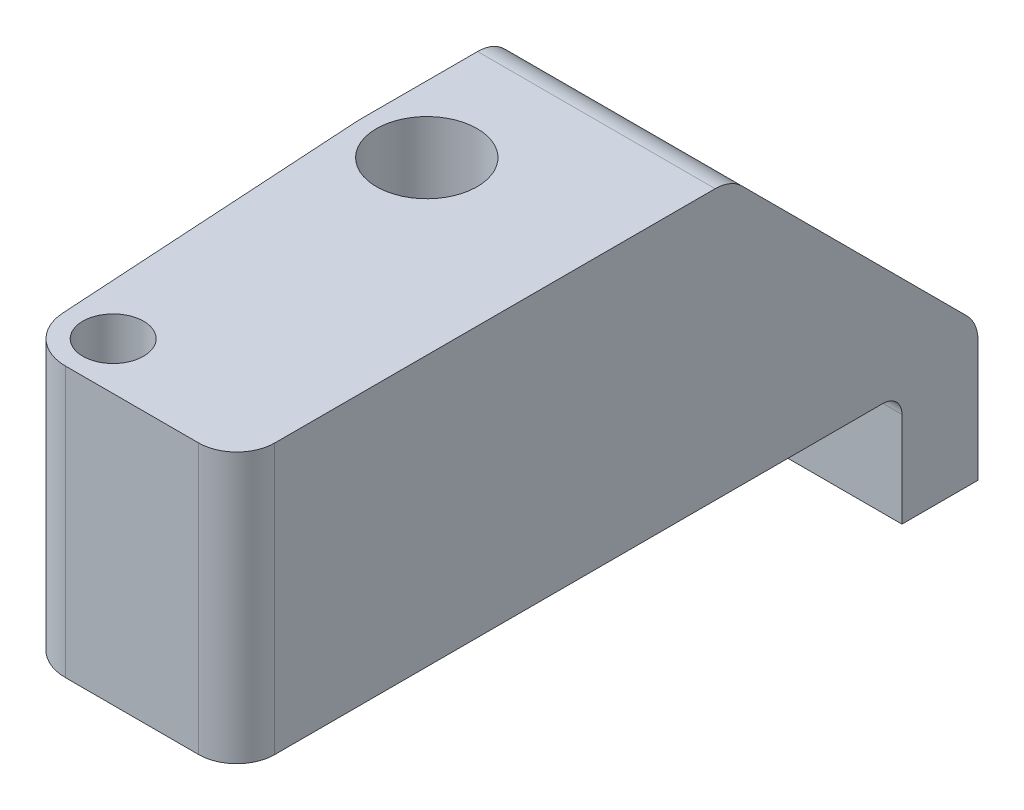
ISO-10303-21;
HEADER;
FILE_DESCRIPTION(('STEP AP214'),'2;1');
FILE_NAME('part.step','',(''),(''),'','','');
FILE_SCHEMA(('AUTOMOTIVE_DESIGN { 1 0 10303 214 1 1 1 1 }'));
ENDSEC;
DATA;
#1=APPLICATION_CONTEXT('core data for automotive mechanical design processes');
#2=APPLICATION_PROTOCOL_DEFINITION('international standard','automotive_design',2000,#1);
#3=PRODUCT_CONTEXT('',#1,'mechanical');
#4=PRODUCT('Part','Part','',(#3));
#5=PRODUCT_RELATED_PRODUCT_CATEGORY('part','',(#4));
#6=PRODUCT_DEFINITION_FORMATION('','',#4);
#7=PRODUCT_DEFINITION_CONTEXT('part definition',#1,'design');
#8=PRODUCT_DEFINITION('design','',#6,#7);
#9=PRODUCT_DEFINITION_SHAPE('','',#8);
#10=(LENGTH_UNIT() NAMED_UNIT(*) SI_UNIT(.MILLI.,.METRE.));
#11=(NAMED_UNIT(*) PLANE_ANGLE_UNIT() SI_UNIT($,.RADIAN.));
#12=(NAMED_UNIT(*) SI_UNIT($,.STERADIAN.) SOLID_ANGLE_UNIT());
#13=UNCERTAINTY_MEASURE_WITH_UNIT(LENGTH_MEASURE(1.E-05),#10,'distance_accuracy_value','');
#14=(GEOMETRIC_REPRESENTATION_CONTEXT(3) GLOBAL_UNCERTAINTY_ASSIGNED_CONTEXT((#13)) GLOBAL_UNIT_ASSIGNED_CONTEXT((#10,
#11,#12)) REPRESENTATION_CONTEXT('',''));
#15=CARTESIAN_POINT('',(0.,0.,0.));
#16=DIRECTION('',(0.,0.,1.));
#17=DIRECTION('',(1.,0.,0.));
#18=AXIS2_PLACEMENT_3D('',#15,#16,#17);
#19=CARTESIAN_POINT('',(9.,29.369351802563,-32.5));
#20=DIRECTION('',(0.,0.,1.));
#21=DIRECTION('',(1.,0.,0.));
#22=AXIS2_PLACEMENT_3D('',#19,#20,#21);
#23=PLANE('',#22);
#24=DIRECTION('',(0.,-1.,0.));
#25=VECTOR('',#24,1.);
#26=CARTESIAN_POINT('',(-3.5,14.2,-32.5));
#27=LINE('',#26,#25);
#28=CARTESIAN_POINT('',(-3.5,0.,-32.5));
#29=VERTEX_POINT('',#28);
#30=CARTESIAN_POINT('',(-3.5,-0.999999999999999,-32.5));
#31=VERTEX_POINT('',#30);
#32=EDGE_CURVE('E175',#29,#31,#27,.T.);
#33=ORIENTED_EDGE('',*,*,#32,.F.);
#34=DIRECTION('',(-1.,0.,0.));
#35=VECTOR('',#34,1.);
#36=CARTESIAN_POINT('',(9.,0.,-32.5));
#37=LINE('',#36,#35);
#38=CARTESIAN_POINT('',(-5.63247190702654,0.,-32.5));
#39=VERTEX_POINT('',#38);
#40=EDGE_CURVE('E159',#29,#39,#37,.T.);
#41=ORIENTED_EDGE('',*,*,#40,.T.);
#42=DIRECTION('',(0.,-1.,0.));
#43=VECTOR('',#42,1.);
#44=CARTESIAN_POINT('',(-5.63247190702654,29.369351802563,-32.5));
#45=LINE('',#44,#43);
#46=CARTESIAN_POINT('',(-5.63247190702654,-6.,-32.5));
#47=VERTEX_POINT('',#46);
#48=EDGE_CURVE('E269',#39,#47,#45,.T.);
#49=ORIENTED_EDGE('',*,*,#48,.T.);
#50=DIRECTION('',(-1.,0.,0.));
#51=VECTOR('',#50,1.);
#52=CARTESIAN_POINT('',(9.,-6.,-32.5));
#53=LINE('',#52,#51);
#54=CARTESIAN_POINT('',(9.,-6.,-32.5));
#55=VERTEX_POINT('',#54);
#56=EDGE_CURVE('E260',#55,#47,#53,.T.);
#57=ORIENTED_EDGE('',*,*,#56,.F.);
#58=DIRECTION('',(0.,-1.,0.));
#59=VECTOR('',#58,1.);
#60=CARTESIAN_POINT('',(9.,29.369351802563,-32.5));
#61=LINE('',#60,#59);
#62=CARTESIAN_POINT('',(9.,-1.,-32.5));
#63=VERTEX_POINT('',#62);
#64=EDGE_CURVE('E272',#63,#55,#61,.T.);
#65=ORIENTED_EDGE('',*,*,#64,.F.);
#66=DIRECTION('',(1.,0.,0.));
#67=VECTOR('',#66,1.);
#68=CARTESIAN_POINT('',(9.,-1.,-32.5));
#69=LINE('',#68,#67);
#70=EDGE_CURVE('E182',#63,#31,#69,.F.);
#71=ORIENTED_EDGE('',*,*,#70,.T.);
#72=EDGE_LOOP('',(#33,#41,#49,#57,#65,#71));
#73=FACE_BOUND('',#72,.T.);
#74=ADVANCED_FACE('F41',(#73),#23,.T.);
#75=CARTESIAN_POINT('',(-5.63247190702654,29.369351802563,-32.5));
#76=DIRECTION('',(-1.,0.,0.));
#77=DIRECTION('',(0.,0.,1.));
#78=AXIS2_PLACEMENT_3D('',#75,#76,#77);
#79=PLANE('',#78);
#80=ORIENTED_EDGE('',*,*,#48,.F.);
#81=DIRECTION('',(0.,0.,-1.));
#82=VECTOR('',#81,1.);
#83=CARTESIAN_POINT('',(-5.63247190702654,0.,-32.5));
#84=LINE('',#83,#82);
#85=CARTESIAN_POINT('',(-5.63247190702654,0.,-36.5));
#86=VERTEX_POINT('',#85);
#87=EDGE_CURVE('E165',#39,#86,#84,.T.);
#88=ORIENTED_EDGE('',*,*,#87,.T.);
#89=DIRECTION('',(0.,-1.,0.));
#90=VECTOR('',#89,1.);
#91=CARTESIAN_POINT('',(-5.63247190702654,29.369351802563,-36.5));
#92=LINE('',#91,#90);
#93=CARTESIAN_POINT('',(-5.63247190702654,-6.,-36.5));
#94=VERTEX_POINT('',#93);
#95=EDGE_CURVE('E273',#86,#94,#92,.T.);
#96=ORIENTED_EDGE('',*,*,#95,.T.);
#97=DIRECTION('',(0.,0.,-1.));
#98=VECTOR('',#97,1.);
#99=CARTESIAN_POINT('',(-5.63247190702654,-6.,-32.5));
#100=LINE('',#99,#98);
#101=EDGE_CURVE('E263',#47,#94,#100,.T.);
#102=ORIENTED_EDGE('',*,*,#101,.F.);
#103=EDGE_LOOP('',(#80,#88,#96,#102));
#104=FACE_BOUND('',#103,.T.);
#105=ADVANCED_FACE('F354',(#104),#79,.T.);
#106=CARTESIAN_POINT('',(9.,14.2,0.));
#107=DIRECTION('',(-1.,0.,0.));
#108=DIRECTION('',(0.,0.,1.));
#109=AXIS2_PLACEMENT_3D('',#106,#107,#108);
#110=PLANE('',#109);
#111=DIRECTION('',(0.,-0.707106781186548,-0.707106781186547));
#112=VECTOR('',#111,1.);
#113=CARTESIAN_POINT('',(9.,1.19999999999995,-36.5));
#114=LINE('',#113,#112);
#115=CARTESIAN_POINT('',(9.,1.78578643762686,-35.9142135623731));
#116=VERTEX_POINT('',#115);
#117=CARTESIAN_POINT('',(9.,13.6142135623731,-24.0857864376269));
#118=VERTEX_POINT('',#117);
#119=EDGE_CURVE('E211',#116,#118,#114,.F.);
#120=ORIENTED_EDGE('',*,*,#119,.T.);
#121=CARTESIAN_POINT('',(9.,12.2,-22.6715728752538));
#122=DIRECTION('',(-1.,0.,0.));
#123=DIRECTION('',(0.,0.,1.));
#124=AXIS2_PLACEMENT_3D('',#121,#122,#123);
#125=CIRCLE('',#124,2.);
#126=CARTESIAN_POINT('',(9.,14.2,-22.6715728752538));
#127=VERTEX_POINT('',#126);
#128=EDGE_CURVE('E49',#118,#127,#125,.F.);
#129=ORIENTED_EDGE('',*,*,#128,.T.);
#130=DIRECTION('',(0.,0.,-1.));
#131=VECTOR('',#130,1.);
#132=CARTESIAN_POINT('',(9.,14.2,0.));
#133=LINE('',#132,#131);
#134=CARTESIAN_POINT('',(9.,14.2,0.5));
#135=VERTEX_POINT('',#134);
#136=EDGE_CURVE('E235',#135,#127,#133,.T.);
#137=ORIENTED_EDGE('',*,*,#136,.F.);
#138=DIRECTION('',(0.,-1.,0.));
#139=VECTOR('',#138,1.);
#140=CARTESIAN_POINT('',(9.,14.2,0.5));
#141=LINE('',#140,#139);
#142=CARTESIAN_POINT('',(9.,0.,0.5));
#143=VERTEX_POINT('',#142);
#144=EDGE_CURVE('E198',#135,#143,#141,.T.);
#145=ORIENTED_EDGE('',*,*,#144,.T.);
#146=DIRECTION('',(0.,0.,-1.));
#147=VECTOR('',#146,1.);
#148=CARTESIAN_POINT('',(9.,0.,0.));
#149=LINE('',#148,#147);
#150=CARTESIAN_POINT('',(9.,0.,-31.5));
#151=VERTEX_POINT('',#150);
#152=EDGE_CURVE('E289',#143,#151,#149,.T.);
#153=ORIENTED_EDGE('',*,*,#152,.T.);
#154=CARTESIAN_POINT('',(9.,-1.,-31.5));
#155=DIRECTION('',(-1.,0.,0.));
#156=DIRECTION('',(0.,0.,1.));
#157=AXIS2_PLACEMENT_3D('',#154,#155,#156);
#158=CIRCLE('',#157,1.);
#159=EDGE_CURVE('E194',#151,#63,#158,.T.);
#160=ORIENTED_EDGE('',*,*,#159,.T.);
#161=ORIENTED_EDGE('',*,*,#64,.T.);
#162=DIRECTION('',(0.,0.,1.));
#163=VECTOR('',#162,1.);
#164=CARTESIAN_POINT('',(9.,-6.,-32.5));
#165=LINE('',#164,#163);
#166=CARTESIAN_POINT('',(9.,-6.,-36.5));
#167=VERTEX_POINT('',#166);
#168=EDGE_CURVE('E169',#167,#55,#165,.T.);
#169=ORIENTED_EDGE('',*,*,#168,.F.);
#170=DIRECTION('',(0.,-1.,0.));
#171=VECTOR('',#170,1.);
#172=CARTESIAN_POINT('',(9.,29.369351802563,-36.5));
#173=LINE('',#172,#171);
#174=CARTESIAN_POINT('',(9.,0.371572875253762,-36.5));
#175=VERTEX_POINT('',#174);
#176=EDGE_CURVE('E270',#175,#167,#173,.T.);
#177=ORIENTED_EDGE('',*,*,#176,.F.);
#178=CARTESIAN_POINT('',(9.,0.371572875253762,-34.5));
#179=DIRECTION('',(-1.,0.,0.));
#180=DIRECTION('',(0.,0.,1.));
#181=AXIS2_PLACEMENT_3D('',#178,#179,#180);
#182=CIRCLE('',#181,2.);
#183=EDGE_CURVE('E56',#175,#116,#182,.F.);
#184=ORIENTED_EDGE('',*,*,#183,.T.);
#185=EDGE_LOOP('',(#120,#129,#137,#145,#153,#160,#161,#169,#177,#184));
#186=FACE_BOUND('',#185,.T.);
#187=ADVANCED_FACE('F234',(#186),#110,.F.);
#188=CARTESIAN_POINT('',(-3.5,14.2,0.));
#189=DIRECTION('',(-1.,0.,0.));
#190=DIRECTION('',(0.,0.,1.));
#191=AXIS2_PLACEMENT_3D('',#188,#189,#190);
#192=PLANE('',#191);
#193=DIRECTION('',(0.,0.,-1.));
#194=VECTOR('',#193,1.);
#195=CARTESIAN_POINT('',(-3.5,14.2,0.));
#196=LINE('',#195,#194);
#197=CARTESIAN_POINT('',(-3.5,14.2,-16.5));
#198=VERTEX_POINT('',#197);
#199=CARTESIAN_POINT('',(-3.5,14.2,-22.6715728752538));
#200=VERTEX_POINT('',#199);
#201=EDGE_CURVE('E245',#198,#200,#196,.T.);
#202=ORIENTED_EDGE('',*,*,#201,.T.);
#203=CARTESIAN_POINT('',(-3.5,12.2,-22.6715728752538));
#204=DIRECTION('',(-1.,0.,0.));
#205=DIRECTION('',(0.,0.,1.));
#206=AXIS2_PLACEMENT_3D('',#203,#204,#205);
#207=CIRCLE('',#206,2.);
#208=CARTESIAN_POINT('',(-3.5,13.6142135623731,-24.0857864376269));
#209=VERTEX_POINT('',#208);
#210=EDGE_CURVE('E223',#200,#209,#207,.T.);
#211=ORIENTED_EDGE('',*,*,#210,.T.);
#212=DIRECTION('',(0.,0.707106781186548,0.707106781186547));
#213=VECTOR('',#212,1.);
#214=CARTESIAN_POINT('',(-3.5,25.95,-11.75));
#215=LINE('',#214,#213);
#216=CARTESIAN_POINT('',(-3.5,1.78578643762686,-35.9142135623731));
#217=VERTEX_POINT('',#216);
#218=EDGE_CURVE('E214',#209,#217,#215,.F.);
#219=ORIENTED_EDGE('',*,*,#218,.T.);
#220=CARTESIAN_POINT('',(-3.5,0.371572875253762,-34.5));
#221=DIRECTION('',(-1.,0.,0.));
#222=DIRECTION('',(0.,0.,1.));
#223=AXIS2_PLACEMENT_3D('',#220,#221,#222);
#224=CIRCLE('',#223,2.);
#225=CARTESIAN_POINT('',(-3.5,0.371572875253762,-36.5));
#226=VERTEX_POINT('',#225);
#227=EDGE_CURVE('E221',#217,#226,#224,.T.);
#228=ORIENTED_EDGE('',*,*,#227,.T.);
#229=DIRECTION('',(0.,-1.,0.));
#230=VECTOR('',#229,1.);
#231=CARTESIAN_POINT('',(-3.5,29.369351802563,-36.5));
#232=LINE('',#231,#230);
#233=CARTESIAN_POINT('',(-3.5,0.,-36.5));
#234=VERTEX_POINT('',#233);
#235=EDGE_CURVE('E178',#226,#234,#232,.T.);
#236=ORIENTED_EDGE('',*,*,#235,.T.);
#237=DIRECTION('',(0.,0.,1.));
#238=VECTOR('',#237,1.);
#239=CARTESIAN_POINT('',(-3.5,0.,-29.7062040878515));
#240=LINE('',#239,#238);
#241=EDGE_CURVE('E162',#234,#29,#240,.T.);
#242=ORIENTED_EDGE('',*,*,#241,.T.);
#243=ORIENTED_EDGE('',*,*,#32,.T.);
#244=CARTESIAN_POINT('',(-3.5,-1.,-31.5));
#245=DIRECTION('',(-1.,0.,0.));
#246=DIRECTION('',(0.,0.,1.));
#247=AXIS2_PLACEMENT_3D('',#244,#245,#246);
#248=CIRCLE('',#247,1.);
#249=CARTESIAN_POINT('',(-3.5,0.,-31.5));
#250=VERTEX_POINT('',#249);
#251=EDGE_CURVE('E196',#31,#250,#248,.F.);
#252=ORIENTED_EDGE('',*,*,#251,.T.);
#253=DIRECTION('',(0.,0.,-1.));
#254=VECTOR('',#253,1.);
#255=CARTESIAN_POINT('',(-3.5,0.,0.));
#256=LINE('',#255,#254);
#257=CARTESIAN_POINT('',(-3.5,0.,-16.5));
#258=VERTEX_POINT('',#257);
#259=EDGE_CURVE('E303',#258,#250,#256,.T.);
#260=ORIENTED_EDGE('',*,*,#259,.F.);
#261=DIRECTION('',(0.,-1.,0.));
#262=VECTOR('',#261,1.);
#263=CARTESIAN_POINT('',(-3.5,14.2,-16.5));
#264=LINE('',#263,#262);
#265=EDGE_CURVE('E185',#198,#258,#264,.T.);
#266=ORIENTED_EDGE('',*,*,#265,.F.);
#267=EDGE_LOOP('',(#202,#211,#219,#228,#236,#242,#243,#252,#260,#266));
#268=FACE_BOUND('',#267,.T.);
#269=ADVANCED_FACE('F173',(#268),#192,.T.);
#270=CARTESIAN_POINT('',(0.,14.2,-16.5));
#271=DIRECTION('',(0.,-1.,0.));
#272=DIRECTION('',(0.,0.,-1.));
#273=AXIS2_PLACEMENT_3D('',#270,#271,#272);
#274=CYLINDRICAL_SURFACE('',#273,3.49999999999994);
#275=CARTESIAN_POINT('',(0.,0.,-16.5));
#276=DIRECTION('',(0.,1.,0.));
#277=DIRECTION('',(0.,0.,1.));
#278=AXIS2_PLACEMENT_3D('',#275,#276,#277);
#279=CIRCLE('',#278,3.49999999999994);
#280=CARTESIAN_POINT('',(-3.49356617103043,0.,-16.2878787878788));
#281=VERTEX_POINT('',#280);
#282=EDGE_CURVE('E305',#258,#281,#279,.T.);
#283=ORIENTED_EDGE('',*,*,#282,.T.);
#284=DIRECTION('',(0.,-1.,0.));
#285=VECTOR('',#284,1.);
#286=CARTESIAN_POINT('',(-3.49356617103043,14.2,-16.2878787878788));
#287=LINE('',#286,#285);
#288=CARTESIAN_POINT('',(-3.49356617103043,14.2,-16.2878787878788));
#289=VERTEX_POINT('',#288);
#290=EDGE_CURVE('E189',#289,#281,#287,.T.);
#291=ORIENTED_EDGE('',*,*,#290,.F.);
#292=CARTESIAN_POINT('',(0.,14.2,-16.5));
#293=DIRECTION('',(0.,1.,0.));
#294=DIRECTION('',(0.,0.,1.));
#295=AXIS2_PLACEMENT_3D('',#292,#293,#294);
#296=CIRCLE('',#295,3.49999999999994);
#297=EDGE_CURVE('E292',#198,#289,#296,.T.);
#298=ORIENTED_EDGE('',*,*,#297,.F.);
#299=ORIENTED_EDGE('',*,*,#265,.T.);
#300=EDGE_LOOP('',(#283,#291,#298,#299));
#301=FACE_BOUND('',#300,.T.);
#302=ADVANCED_FACE('F386',(#301),#274,.T.);
#303=CARTESIAN_POINT('',(-2.49540440787888,14.2,0.151515151515152));
#304=DIRECTION('',(0.998161763151552,0.,-0.0606060606060606));
#305=DIRECTION('',(-0.0606060606060606,0.,-0.998161763151552));
#306=AXIS2_PLACEMENT_3D('',#303,#304,#305);
#307=PLANE('',#306);
#308=DIRECTION('',(0.0606060606060606,0.,0.998161763151552));
#309=VECTOR('',#308,1.);
#310=CARTESIAN_POINT('',(-2.49540440787888,0.,0.151515151515152));
#311=LINE('',#310,#309);
#312=CARTESIAN_POINT('',(-2.49540440787888,0.,0.151515151515152));
#313=VERTEX_POINT('',#312);
#314=EDGE_CURVE('E307',#281,#313,#311,.T.);
#315=ORIENTED_EDGE('',*,*,#314,.T.);
#316=DIRECTION('',(0.,-1.,0.));
#317=VECTOR('',#316,1.);
#318=CARTESIAN_POINT('',(-2.49540440787888,14.2,0.151515151515152));
#319=LINE('',#318,#317);
#320=CARTESIAN_POINT('',(-2.49540440787888,14.2,0.151515151515152));
#321=VERTEX_POINT('',#320);
#322=EDGE_CURVE('E315',#321,#313,#319,.T.);
#323=ORIENTED_EDGE('',*,*,#322,.F.);
#324=DIRECTION('',(0.0606060606060606,0.,0.998161763151552));
#325=VECTOR('',#324,1.);
#326=CARTESIAN_POINT('',(-2.49540440787888,14.2,0.151515151515152));
#327=LINE('',#326,#325);
#328=EDGE_CURVE('E294',#289,#321,#327,.T.);
#329=ORIENTED_EDGE('',*,*,#328,.F.);
#330=ORIENTED_EDGE('',*,*,#290,.T.);
#331=EDGE_LOOP('',(#315,#323,#329,#330));
#332=FACE_BOUND('',#331,.T.);
#333=ADVANCED_FACE('F322',(#332),#307,.F.);
#334=CARTESIAN_POINT('',(0.,14.2,0.));
#335=DIRECTION('',(0.,-1.,0.));
#336=DIRECTION('',(0.,0.,-1.));
#337=AXIS2_PLACEMENT_3D('',#334,#335,#336);
#338=CYLINDRICAL_SURFACE('',#337,2.5);
#339=CARTESIAN_POINT('',(0.,0.,0.));
#340=DIRECTION('',(0.,1.,0.));
#341=DIRECTION('',(0.,0.,1.));
#342=AXIS2_PLACEMENT_3D('',#339,#340,#341);
#343=CIRCLE('',#342,2.5);
#344=CARTESIAN_POINT('',(0.,0.,2.5));
#345=VERTEX_POINT('',#344);
#346=EDGE_CURVE('E309',#313,#345,#343,.T.);
#347=ORIENTED_EDGE('',*,*,#346,.T.);
#348=DIRECTION('',(0.,-1.,0.));
#349=VECTOR('',#348,1.);
#350=CARTESIAN_POINT('',(0.,14.2,2.5));
#351=LINE('',#350,#349);
#352=CARTESIAN_POINT('',(0.,14.2,2.5));
#353=VERTEX_POINT('',#352);
#354=EDGE_CURVE('E301',#353,#345,#351,.T.);
#355=ORIENTED_EDGE('',*,*,#354,.F.);
#356=CARTESIAN_POINT('',(0.,14.2,0.));
#357=DIRECTION('',(0.,1.,0.));
#358=DIRECTION('',(0.,0.,1.));
#359=AXIS2_PLACEMENT_3D('',#356,#357,#358);
#360=CIRCLE('',#359,2.5);
#361=EDGE_CURVE('E297',#321,#353,#360,.T.);
#362=ORIENTED_EDGE('',*,*,#361,.F.);
#363=ORIENTED_EDGE('',*,*,#322,.T.);
#364=EDGE_LOOP('',(#347,#355,#362,#363));
#365=FACE_BOUND('',#364,.T.);
#366=ADVANCED_FACE('F335',(#365),#338,.T.);
#367=CARTESIAN_POINT('',(0.,14.2,2.5));
#368=DIRECTION('',(0.,0.,-1.));
#369=DIRECTION('',(-1.,0.,0.));
#370=AXIS2_PLACEMENT_3D('',#367,#368,#369);
#371=PLANE('',#370);
#372=DIRECTION('',(1.,0.,0.));
#373=VECTOR('',#372,1.);
#374=CARTESIAN_POINT('',(0.,0.,2.5));
#375=LINE('',#374,#373);
#376=CARTESIAN_POINT('',(7.,0.,2.5));
#377=VERTEX_POINT('',#376);
#378=EDGE_CURVE('E246',#345,#377,#375,.T.);
#379=ORIENTED_EDGE('',*,*,#378,.T.);
#380=DIRECTION('',(0.,-1.,0.));
#381=VECTOR('',#380,1.);
#382=CARTESIAN_POINT('',(7.,14.2,2.5));
#383=LINE('',#382,#381);
#384=CARTESIAN_POINT('',(7.,14.2,2.5));
#385=VERTEX_POINT('',#384);
#386=EDGE_CURVE('E204',#377,#385,#383,.F.);
#387=ORIENTED_EDGE('',*,*,#386,.T.);
#388=DIRECTION('',(1.,0.,0.));
#389=VECTOR('',#388,1.);
#390=CARTESIAN_POINT('',(0.,14.2,2.5));
#391=LINE('',#390,#389);
#392=EDGE_CURVE('E299',#353,#385,#391,.T.);
#393=ORIENTED_EDGE('',*,*,#392,.F.);
#394=ORIENTED_EDGE('',*,*,#354,.T.);
#395=EDGE_LOOP('',(#379,#387,#393,#394));
#396=FACE_BOUND('',#395,.T.);
#397=ADVANCED_FACE('F339',(#396),#371,.F.);
#398=CARTESIAN_POINT('',(0.,14.2,0.));
#399=DIRECTION('',(0.,1.,0.));
#400=DIRECTION('',(0.,0.,1.));
#401=AXIS2_PLACEMENT_3D('',#398,#399,#400);
#402=PLANE('',#401);
#403=CARTESIAN_POINT('',(0.,14.2,-16.5));
#404=DIRECTION('',(0.,-1.,0.));
#405=DIRECTION('',(0.,0.,-1.));
#406=AXIS2_PLACEMENT_3D('',#403,#404,#405);
#407=CIRCLE('',#406,2.65);
#408=CARTESIAN_POINT('',(0.,14.2,-19.15));
#409=VERTEX_POINT('',#408);
#410=EDGE_CURVE('E280',#409,#409,#407,.T.);
#411=ORIENTED_EDGE('',*,*,#410,.T.);
#412=EDGE_LOOP('',(#411));
#413=FACE_BOUND('',#412,.T.);
#414=CARTESIAN_POINT('',(0.,14.2,0.));
#415=DIRECTION('',(0.,-1.,0.));
#416=DIRECTION('',(0.,0.,-1.));
#417=AXIS2_PLACEMENT_3D('',#414,#415,#416);
#418=CIRCLE('',#417,1.6);
#419=CARTESIAN_POINT('',(0.,14.2,-1.6));
#420=VERTEX_POINT('',#419);
#421=EDGE_CURVE('E287',#420,#420,#418,.T.);
#422=ORIENTED_EDGE('',*,*,#421,.T.);
#423=EDGE_LOOP('',(#422));
#424=FACE_BOUND('',#423,.T.);
#425=ORIENTED_EDGE('',*,*,#136,.T.);
#426=DIRECTION('',(1.,0.,0.));
#427=VECTOR('',#426,1.);
#428=CARTESIAN_POINT('',(0.,14.2,-22.6715728752538));
#429=LINE('',#428,#427);
#430=EDGE_CURVE('E217',#127,#200,#429,.F.);
#431=ORIENTED_EDGE('',*,*,#430,.T.);
#432=ORIENTED_EDGE('',*,*,#201,.F.);
#433=ORIENTED_EDGE('',*,*,#297,.T.);
#434=ORIENTED_EDGE('',*,*,#328,.T.);
#435=ORIENTED_EDGE('',*,*,#361,.T.);
#436=ORIENTED_EDGE('',*,*,#392,.T.);
#437=CARTESIAN_POINT('',(7.,14.2,0.5));
#438=DIRECTION('',(0.,1.,0.));
#439=DIRECTION('',(0.,0.,1.));
#440=AXIS2_PLACEMENT_3D('',#437,#438,#439);
#441=CIRCLE('',#440,2.);
#442=EDGE_CURVE('E206',#385,#135,#441,.T.);
#443=ORIENTED_EDGE('',*,*,#442,.T.);
#444=EDGE_LOOP('',(#425,#431,#432,#433,#434,#435,#436,#443));
#445=FACE_BOUND('',#444,.T.);
#446=ADVANCED_FACE('F240',(#413,#424,#445),#402,.T.);
#447=CARTESIAN_POINT('',(0.,0.,0.));
#448=DIRECTION('',(0.,1.,0.));
#449=DIRECTION('',(0.,0.,1.));
#450=AXIS2_PLACEMENT_3D('',#447,#448,#449);
#451=PLANE('',#450);
#452=CARTESIAN_POINT('',(0.,0.,-16.5));
#453=DIRECTION('',(0.,-1.,0.));
#454=DIRECTION('',(0.,0.,-1.));
#455=AXIS2_PLACEMENT_3D('',#452,#453,#454);
#456=CIRCLE('',#455,2.65);
#457=CARTESIAN_POINT('',(0.,0.,-19.15));
#458=VERTEX_POINT('',#457);
#459=EDGE_CURVE('E277',#458,#458,#456,.T.);
#460=ORIENTED_EDGE('',*,*,#459,.F.);
#461=EDGE_LOOP('',(#460));
#462=FACE_BOUND('',#461,.T.);
#463=CARTESIAN_POINT('',(0.,0.,0.));
#464=DIRECTION('',(0.,-1.,0.));
#465=DIRECTION('',(0.,0.,-1.));
#466=AXIS2_PLACEMENT_3D('',#463,#464,#465);
#467=CIRCLE('',#466,1.6);
#468=CARTESIAN_POINT('',(0.,0.,-1.6));
#469=VERTEX_POINT('',#468);
#470=EDGE_CURVE('E284',#469,#469,#467,.T.);
#471=ORIENTED_EDGE('',*,*,#470,.F.);
#472=EDGE_LOOP('',(#471));
#473=FACE_BOUND('',#472,.T.);
#474=ORIENTED_EDGE('',*,*,#152,.F.);
#475=CARTESIAN_POINT('',(7.,0.,0.5));
#476=DIRECTION('',(0.,1.,0.));
#477=DIRECTION('',(0.,0.,1.));
#478=AXIS2_PLACEMENT_3D('',#475,#476,#477);
#479=CIRCLE('',#478,2.);
#480=EDGE_CURVE('E202',#143,#377,#479,.F.);
#481=ORIENTED_EDGE('',*,*,#480,.T.);
#482=ORIENTED_EDGE('',*,*,#378,.F.);
#483=ORIENTED_EDGE('',*,*,#346,.F.);
#484=ORIENTED_EDGE('',*,*,#314,.F.);
#485=ORIENTED_EDGE('',*,*,#282,.F.);
#486=ORIENTED_EDGE('',*,*,#259,.T.);
#487=DIRECTION('',(1.,0.,0.));
#488=VECTOR('',#487,1.);
#489=CARTESIAN_POINT('',(0.,0.,-31.5));
#490=LINE('',#489,#488);
#491=EDGE_CURVE('E184',#250,#151,#490,.T.);
#492=ORIENTED_EDGE('',*,*,#491,.T.);
#493=EDGE_LOOP('',(#474,#481,#482,#483,#484,#485,#486,#492));
#494=FACE_BOUND('',#493,.T.);
#495=ADVANCED_FACE('F330',(#462,#473,#494),#451,.F.);
#496=CARTESIAN_POINT('',(0.,0.,0.));
#497=DIRECTION('',(0.,-1.,0.));
#498=DIRECTION('',(0.,0.,-1.));
#499=AXIS2_PLACEMENT_3D('',#496,#497,#498);
#500=CYLINDRICAL_SURFACE('',#499,1.6);
#501=ORIENTED_EDGE('',*,*,#421,.F.);
#502=EDGE_LOOP('',(#501));
#503=FACE_BOUND('',#502,.T.);
#504=ORIENTED_EDGE('',*,*,#470,.T.);
#505=EDGE_LOOP('',(#504));
#506=FACE_BOUND('',#505,.T.);
#507=ADVANCED_FACE('F369',(#503,#506),#500,.F.);
#508=CARTESIAN_POINT('',(0.,0.,-16.5));
#509=DIRECTION('',(0.,-1.,0.));
#510=DIRECTION('',(0.,0.,-1.));
#511=AXIS2_PLACEMENT_3D('',#508,#509,#510);
#512=CYLINDRICAL_SURFACE('',#511,2.65);
#513=ORIENTED_EDGE('',*,*,#410,.F.);
#514=EDGE_LOOP('',(#513));
#515=FACE_BOUND('',#514,.T.);
#516=ORIENTED_EDGE('',*,*,#459,.T.);
#517=EDGE_LOOP('',(#516));
#518=FACE_BOUND('',#517,.T.);
#519=ADVANCED_FACE('F366',(#515,#518),#512,.F.);
#520=CARTESIAN_POINT('',(9.,29.369351802563,-36.5));
#521=DIRECTION('',(0.,0.,-1.));
#522=DIRECTION('',(-1.,0.,0.));
#523=AXIS2_PLACEMENT_3D('',#520,#521,#522);
#524=PLANE('',#523);
#525=ORIENTED_EDGE('',*,*,#235,.F.);
#526=DIRECTION('',(-1.,0.,0.));
#527=VECTOR('',#526,1.);
#528=CARTESIAN_POINT('',(9.,0.371572875253762,-36.5));
#529=LINE('',#528,#527);
#530=EDGE_CURVE('E11',#226,#175,#529,.F.);
#531=ORIENTED_EDGE('',*,*,#530,.T.);
#532=ORIENTED_EDGE('',*,*,#176,.T.);
#533=DIRECTION('',(1.,0.,0.));
#534=VECTOR('',#533,1.);
#535=CARTESIAN_POINT('',(9.,-6.,-36.5));
#536=LINE('',#535,#534);
#537=EDGE_CURVE('E266',#94,#167,#536,.T.);
#538=ORIENTED_EDGE('',*,*,#537,.F.);
#539=ORIENTED_EDGE('',*,*,#95,.F.);
#540=DIRECTION('',(1.,0.,0.));
#541=VECTOR('',#540,1.);
#542=CARTESIAN_POINT('',(9.,0.,-36.5));
#543=LINE('',#542,#541);
#544=EDGE_CURVE('E209',#86,#234,#543,.T.);
#545=ORIENTED_EDGE('',*,*,#544,.T.);
#546=EDGE_LOOP('',(#525,#531,#532,#538,#539,#545));
#547=FACE_BOUND('',#546,.T.);
#548=ADVANCED_FACE('F252',(#547),#524,.T.);
#549=CARTESIAN_POINT('',(0.,-6.,0.));
#550=DIRECTION('',(0.,1.,0.));
#551=DIRECTION('',(0.,0.,1.));
#552=AXIS2_PLACEMENT_3D('',#549,#550,#551);
#553=PLANE('',#552);
#554=ORIENTED_EDGE('',*,*,#168,.T.);
#555=ORIENTED_EDGE('',*,*,#56,.T.);
#556=ORIENTED_EDGE('',*,*,#101,.T.);
#557=ORIENTED_EDGE('',*,*,#537,.T.);
#558=EDGE_LOOP('',(#554,#555,#556,#557));
#559=FACE_BOUND('',#558,.T.);
#560=ADVANCED_FACE('F351',(#559),#553,.F.);
#561=CARTESIAN_POINT('',(0.,-1.,-31.5));
#562=DIRECTION('',(1.,0.,0.));
#563=DIRECTION('',(0.,0.,-1.));
#564=AXIS2_PLACEMENT_3D('',#561,#562,#563);
#565=CYLINDRICAL_SURFACE('',#564,1.);
#566=ORIENTED_EDGE('',*,*,#251,.F.);
#567=ORIENTED_EDGE('',*,*,#70,.F.);
#568=ORIENTED_EDGE('',*,*,#159,.F.);
#569=ORIENTED_EDGE('',*,*,#491,.F.);
#570=EDGE_LOOP('',(#566,#567,#568,#569));
#571=FACE_BOUND('',#570,.T.);
#572=ADVANCED_FACE('F346',(#571),#565,.F.);
#573=CARTESIAN_POINT('',(7.,14.2,0.5));
#574=DIRECTION('',(0.,-1.,0.));
#575=DIRECTION('',(0.,0.,-1.));
#576=AXIS2_PLACEMENT_3D('',#573,#574,#575);
#577=CYLINDRICAL_SURFACE('',#576,2.);
#578=ORIENTED_EDGE('',*,*,#442,.F.);
#579=ORIENTED_EDGE('',*,*,#386,.F.);
#580=ORIENTED_EDGE('',*,*,#480,.F.);
#581=ORIENTED_EDGE('',*,*,#144,.F.);
#582=EDGE_LOOP('',(#578,#579,#580,#581));
#583=FACE_BOUND('',#582,.T.);
#584=ADVANCED_FACE('F342',(#583),#577,.T.);
#585=CARTESIAN_POINT('',(0.,0.,0.));
#586=DIRECTION('',(0.,1.,0.));
#587=DIRECTION('',(0.,0.,1.));
#588=AXIS2_PLACEMENT_3D('',#585,#586,#587);
#589=PLANE('',#588);
#590=ORIENTED_EDGE('',*,*,#241,.F.);
#591=ORIENTED_EDGE('',*,*,#544,.F.);
#592=ORIENTED_EDGE('',*,*,#87,.F.);
#593=ORIENTED_EDGE('',*,*,#40,.F.);
#594=EDGE_LOOP('',(#590,#591,#592,#593));
#595=FACE_BOUND('',#594,.T.);
#596=ADVANCED_FACE('F161',(#595),#589,.T.);
#597=CARTESIAN_POINT('',(9.,1.19999999999995,-36.5));
#598=DIRECTION('',(0.,-0.707106781186547,0.707106781186548));
#599=DIRECTION('',(1.,0.,0.));
#600=AXIS2_PLACEMENT_3D('',#597,#598,#599);
#601=PLANE('',#600);
#602=ORIENTED_EDGE('',*,*,#218,.F.);
#603=DIRECTION('',(-1.,0.,0.));
#604=VECTOR('',#603,1.);
#605=CARTESIAN_POINT('',(9.,13.6142135623731,-24.0857864376269));
#606=LINE('',#605,#604);
#607=EDGE_CURVE('E65',#209,#118,#606,.F.);
#608=ORIENTED_EDGE('',*,*,#607,.T.);
#609=ORIENTED_EDGE('',*,*,#119,.F.);
#610=DIRECTION('',(1.,0.,0.));
#611=VECTOR('',#610,1.);
#612=CARTESIAN_POINT('',(9.,1.78578643762686,-35.9142135623731));
#613=LINE('',#612,#611);
#614=EDGE_CURVE('E225',#116,#217,#613,.F.);
#615=ORIENTED_EDGE('',*,*,#614,.T.);
#616=EDGE_LOOP('',(#602,#608,#609,#615));
#617=FACE_BOUND('',#616,.T.);
#618=ADVANCED_FACE('F250',(#617),#601,.F.);
#619=CARTESIAN_POINT('',(0.,12.2,-22.6715728752538));
#620=DIRECTION('',(1.,0.,0.));
#621=DIRECTION('',(0.,0.,-1.));
#622=AXIS2_PLACEMENT_3D('',#619,#620,#621);
#623=CYLINDRICAL_SURFACE('',#622,2.);
#624=ORIENTED_EDGE('',*,*,#128,.F.);
#625=ORIENTED_EDGE('',*,*,#607,.F.);
#626=ORIENTED_EDGE('',*,*,#210,.F.);
#627=ORIENTED_EDGE('',*,*,#430,.F.);
#628=EDGE_LOOP('',(#624,#625,#626,#627));
#629=FACE_BOUND('',#628,.T.);
#630=ADVANCED_FACE('F248',(#629),#623,.T.);
#631=CARTESIAN_POINT('',(9.,0.371572875253762,-34.5));
#632=DIRECTION('',(-1.,0.,0.));
#633=DIRECTION('',(0.,0.,1.));
#634=AXIS2_PLACEMENT_3D('',#631,#632,#633);
#635=CYLINDRICAL_SURFACE('',#634,2.);
#636=ORIENTED_EDGE('',*,*,#227,.F.);
#637=ORIENTED_EDGE('',*,*,#614,.F.);
#638=ORIENTED_EDGE('',*,*,#183,.F.);
#639=ORIENTED_EDGE('',*,*,#530,.F.);
#640=EDGE_LOOP('',(#636,#637,#638,#639));
#641=FACE_BOUND('',#640,.T.);
#642=ADVANCED_FACE('F43',(#641),#635,.T.);
#643=CLOSED_SHELL('',(#74,#105,#187,#269,#302,#333,#366,#397,#446,#495,#507,#519,#548,#560,#572,
#584,#596,#618,#630,#642));
#644=MANIFOLD_SOLID_BREP('B2',#643);
#645=ADVANCED_BREP_SHAPE_REPRESENTATION('',(#18,#644),#14);
#646=SHAPE_DEFINITION_REPRESENTATION(#9,#645);
ENDSEC;
END-ISO-10303-21;
